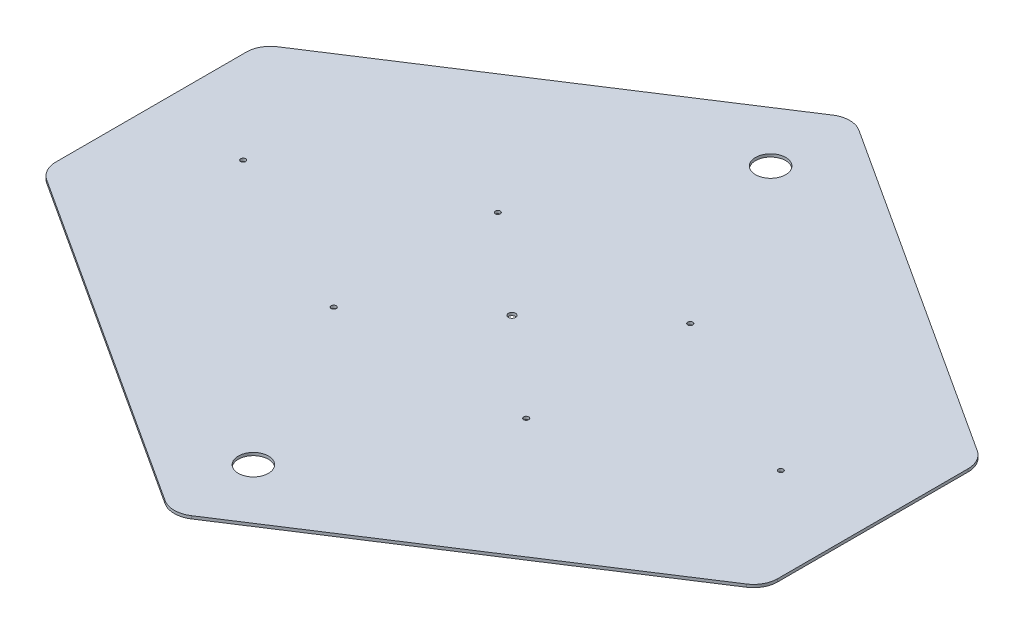
ISO-10303-21;
HEADER;
FILE_DESCRIPTION(('STEP AP214'),'2;1');
FILE_NAME('part.step','',(''),(''),'','','');
FILE_SCHEMA(('AUTOMOTIVE_DESIGN { 1 0 10303 214 1 1 1 1 }'));
ENDSEC;
DATA;
#1=APPLICATION_CONTEXT('core data for automotive mechanical design processes');
#2=APPLICATION_PROTOCOL_DEFINITION('international standard','automotive_design',2000,#1);
#3=PRODUCT_CONTEXT('',#1,'mechanical');
#4=PRODUCT('Part','Part','',(#3));
#5=PRODUCT_RELATED_PRODUCT_CATEGORY('part','',(#4));
#6=PRODUCT_DEFINITION_FORMATION('','',#4);
#7=PRODUCT_DEFINITION_CONTEXT('part definition',#1,'design');
#8=PRODUCT_DEFINITION('design','',#6,#7);
#9=PRODUCT_DEFINITION_SHAPE('','',#8);
#10=(LENGTH_UNIT() NAMED_UNIT(*) SI_UNIT(.MILLI.,.METRE.));
#11=(NAMED_UNIT(*) PLANE_ANGLE_UNIT() SI_UNIT($,.RADIAN.));
#12=(NAMED_UNIT(*) SI_UNIT($,.STERADIAN.) SOLID_ANGLE_UNIT());
#13=UNCERTAINTY_MEASURE_WITH_UNIT(LENGTH_MEASURE(1.E-05),#10,'distance_accuracy_value','');
#14=(GEOMETRIC_REPRESENTATION_CONTEXT(3) GLOBAL_UNCERTAINTY_ASSIGNED_CONTEXT((#13)) GLOBAL_UNIT_ASSIGNED_CONTEXT((#10,
#11,#12)) REPRESENTATION_CONTEXT('',''));
#15=CARTESIAN_POINT('',(0.,0.,0.));
#16=DIRECTION('',(0.,0.,1.));
#17=DIRECTION('',(1.,0.,0.));
#18=AXIS2_PLACEMENT_3D('',#15,#16,#17);
#19=CARTESIAN_POINT('',(-355.6,3.,-100.49901923));
#20=DIRECTION('',(0.,-1.,0.));
#21=DIRECTION('',(0.,0.,-1.));
#22=AXIS2_PLACEMENT_3D('',#19,#20,#21);
#23=CYLINDRICAL_SURFACE('',#22,25.4);
#24=CARTESIAN_POINT('',(-355.6,3.,-100.49901923));
#25=DIRECTION('',(0.,-1.,0.));
#26=DIRECTION('',(0.,0.,-1.));
#27=AXIS2_PLACEMENT_3D('',#24,#25,#26);
#28=CIRCLE('',#27,25.4);
#29=CARTESIAN_POINT('',(-369.420998399086,3.,-121.809580018374));
#30=VERTEX_POINT('',#29);
#31=CARTESIAN_POINT('',(-381.,3.,-100.49901923));
#32=VERTEX_POINT('',#31);
#33=EDGE_CURVE('E208',#30,#32,#28,.F.);
#34=ORIENTED_EDGE('',*,*,#33,.F.);
#35=DIRECTION('',(0.,-1.,0.));
#36=VECTOR('',#35,1.);
#37=CARTESIAN_POINT('',(-369.420998419,1.5,-121.809580055));
#38=LINE('',#37,#36);
#39=CARTESIAN_POINT('',(-369.420998418857,0.,-121.809580055093));
#40=VERTEX_POINT('',#39);
#41=EDGE_CURVE('E131',#30,#40,#38,.T.);
#42=ORIENTED_EDGE('',*,*,#41,.T.);
#43=CARTESIAN_POINT('',(-355.6,0.,-100.49901923));
#44=DIRECTION('',(0.,-1.,0.));
#45=DIRECTION('',(0.,0.,-1.));
#46=AXIS2_PLACEMENT_3D('',#43,#44,#45);
#47=CIRCLE('',#46,25.4);
#48=CARTESIAN_POINT('',(-381.,0.,-100.49901923));
#49=VERTEX_POINT('',#48);
#50=EDGE_CURVE('E235',#40,#49,#47,.F.);
#51=ORIENTED_EDGE('',*,*,#50,.T.);
#52=DIRECTION('',(0.,1.,0.));
#53=VECTOR('',#52,1.);
#54=CARTESIAN_POINT('',(-381.,1.5,-100.49901923));
#55=LINE('',#54,#53);
#56=EDGE_CURVE('E161',#49,#32,#55,.T.);
#57=ORIENTED_EDGE('',*,*,#56,.T.);
#58=EDGE_LOOP('',(#34,#42,#51,#57));
#59=FACE_BOUND('',#58,.T.);
#60=ADVANCED_FACE('F17',(#59),#23,.T.);
#61=CARTESIAN_POINT('',(-381.,0.,100.49901923));
#62=DIRECTION('',(1.,0.,0.));
#63=DIRECTION('',(0.,0.,-1.));
#64=AXIS2_PLACEMENT_3D('',#61,#62,#63);
#65=PLANE('',#64);
#66=ORIENTED_EDGE('',*,*,#56,.F.);
#67=DIRECTION('',(0.,0.,1.));
#68=VECTOR('',#67,1.);
#69=CARTESIAN_POINT('',(-381.,0.,0.));
#70=LINE('',#69,#68);
#71=CARTESIAN_POINT('',(-381.,0.,100.499019234886));
#72=VERTEX_POINT('',#71);
#73=EDGE_CURVE('E234',#49,#72,#70,.T.);
#74=ORIENTED_EDGE('',*,*,#73,.T.);
#75=DIRECTION('',(0.,-1.,0.));
#76=VECTOR('',#75,1.);
#77=CARTESIAN_POINT('',(-381.,1.5,100.499019239771));
#78=LINE('',#77,#76);
#79=CARTESIAN_POINT('',(-381.,3.,100.499019234886));
#80=VERTEX_POINT('',#79);
#81=EDGE_CURVE('E105',#72,#80,#78,.F.);
#82=ORIENTED_EDGE('',*,*,#81,.T.);
#83=DIRECTION('',(0.,0.,1.));
#84=VECTOR('',#83,1.);
#85=CARTESIAN_POINT('',(-381.,3.,0.));
#86=LINE('',#85,#84);
#87=EDGE_CURVE('E207',#32,#80,#86,.T.);
#88=ORIENTED_EDGE('',*,*,#87,.F.);
#89=EDGE_LOOP('',(#66,#74,#82,#88));
#90=FACE_BOUND('',#89,.T.);
#91=ADVANCED_FACE('F263',(#90),#65,.F.);
#92=CARTESIAN_POINT('',(-355.6,3.,100.49901923));
#93=DIRECTION('',(0.,-1.,0.));
#94=DIRECTION('',(0.,0.,-1.));
#95=AXIS2_PLACEMENT_3D('',#92,#93,#94);
#96=CYLINDRICAL_SURFACE('',#95,25.4);
#97=CARTESIAN_POINT('',(-355.6,3.,100.49901923));
#98=DIRECTION('',(0.,-1.,0.));
#99=DIRECTION('',(0.,0.,-1.));
#100=AXIS2_PLACEMENT_3D('',#97,#98,#99);
#101=CIRCLE('',#100,25.4);
#102=CARTESIAN_POINT('',(-369.420998399086,3.,121.809580018374));
#103=VERTEX_POINT('',#102);
#104=EDGE_CURVE('E205',#80,#103,#101,.F.);
#105=ORIENTED_EDGE('',*,*,#104,.F.);
#106=ORIENTED_EDGE('',*,*,#81,.F.);
#107=CARTESIAN_POINT('',(-355.6,0.,100.49901923));
#108=DIRECTION('',(0.,-1.,0.));
#109=DIRECTION('',(0.,0.,-1.));
#110=AXIS2_PLACEMENT_3D('',#107,#108,#109);
#111=CIRCLE('',#110,25.4);
#112=CARTESIAN_POINT('',(-369.420998418857,0.,121.809580055093));
#113=VERTEX_POINT('',#112);
#114=EDGE_CURVE('E21',#72,#113,#111,.F.);
#115=ORIENTED_EDGE('',*,*,#114,.T.);
#116=DIRECTION('',(0.,1.,0.));
#117=VECTOR('',#116,1.);
#118=CARTESIAN_POINT('',(-369.420998419,1.5,121.809580055));
#119=LINE('',#118,#117);
#120=EDGE_CURVE('E112',#113,#103,#119,.T.);
#121=ORIENTED_EDGE('',*,*,#120,.T.);
#122=EDGE_LOOP('',(#105,#106,#115,#121));
#123=FACE_BOUND('',#122,.T.);
#124=ADVANCED_FACE('F129',(#123),#96,.T.);
#125=CARTESIAN_POINT('',(-13.820998419,0.,352.434530661));
#126=DIRECTION('',(0.544133796023305,0.,-0.838998457701364));
#127=DIRECTION('',(-0.838998457701364,0.,-0.544133796023305));
#128=AXIS2_PLACEMENT_3D('',#125,#126,#127);
#129=PLANE('',#128);
#130=DIRECTION('',(0.,-1.,0.));
#131=VECTOR('',#130,1.);
#132=CARTESIAN_POINT('',(-13.8209984173062,1.5,352.434530661708));
#133=LINE('',#132,#131);
#134=CARTESIAN_POINT('',(-13.8209984182382,0.,352.434530661299));
#135=VERTEX_POINT('',#134);
#136=CARTESIAN_POINT('',(-13.8209984292683,3.,352.434530672072));
#137=VERTEX_POINT('',#136);
#138=EDGE_CURVE('E118',#135,#137,#133,.F.);
#139=ORIENTED_EDGE('',*,*,#138,.T.);
#140=DIRECTION('',(0.838998457556023,0.,0.544133796247407));
#141=VECTOR('',#140,1.);
#142=CARTESIAN_POINT('',(-369.42099852,3.,121.809579890415));
#143=LINE('',#142,#141);
#144=EDGE_CURVE('E117',#103,#137,#143,.T.);
#145=ORIENTED_EDGE('',*,*,#144,.F.);
#146=ORIENTED_EDGE('',*,*,#120,.F.);
#147=DIRECTION('',(-0.838998457701364,0.,-0.544133796023305));
#148=VECTOR('',#147,1.);
#149=CARTESIAN_POINT('',(-13.820998419,0.,352.434530661));
#150=LINE('',#149,#148);
#151=EDGE_CURVE('E116',#113,#135,#150,.F.);
#152=ORIENTED_EDGE('',*,*,#151,.T.);
#153=EDGE_LOOP('',(#139,#145,#146,#152));
#154=FACE_BOUND('',#153,.T.);
#155=ADVANCED_FACE('F115',(#154),#129,.F.);
#156=CARTESIAN_POINT('',(0.,3.,331.123969835));
#157=DIRECTION('',(0.,-1.,0.));
#158=DIRECTION('',(0.,0.,-1.));
#159=AXIS2_PLACEMENT_3D('',#156,#157,#158);
#160=CYLINDRICAL_SURFACE('',#159,25.4);
#161=CARTESIAN_POINT('',(0.,3.,331.123969835));
#162=DIRECTION('',(0.,-1.,0.));
#163=DIRECTION('',(0.,0.,-1.));
#164=AXIS2_PLACEMENT_3D('',#161,#162,#163);
#165=CIRCLE('',#164,25.4);
#166=CARTESIAN_POINT('',(13.8209984301152,3.,352.434530671718));
#167=VERTEX_POINT('',#166);
#168=EDGE_CURVE('E202',#137,#167,#165,.F.);
#169=ORIENTED_EDGE('',*,*,#168,.F.);
#170=ORIENTED_EDGE('',*,*,#138,.F.);
#171=CARTESIAN_POINT('',(0.,0.,331.123969835));
#172=DIRECTION('',(0.,-1.,0.));
#173=DIRECTION('',(0.,0.,-1.));
#174=AXIS2_PLACEMENT_3D('',#171,#172,#173);
#175=CIRCLE('',#174,25.4);
#176=CARTESIAN_POINT('',(13.8209984190851,0.,352.434530660945));
#177=VERTEX_POINT('',#176);
#178=EDGE_CURVE('E128',#135,#177,#175,.F.);
#179=ORIENTED_EDGE('',*,*,#178,.T.);
#180=DIRECTION('',(0.,1.,0.));
#181=VECTOR('',#180,1.);
#182=CARTESIAN_POINT('',(13.820998419,1.5,352.434530661));
#183=LINE('',#182,#181);
#184=EDGE_CURVE('E156',#177,#167,#183,.T.);
#185=ORIENTED_EDGE('',*,*,#184,.T.);
#186=EDGE_LOOP('',(#169,#170,#179,#185));
#187=FACE_BOUND('',#186,.T.);
#188=ADVANCED_FACE('F257',(#187),#160,.T.);
#189=CARTESIAN_POINT('',(369.420998419,0.,121.809580055));
#190=DIRECTION('',(-0.544133796023305,0.,-0.838998457701364));
#191=DIRECTION('',(-0.838998457701364,0.,0.544133796023305));
#192=AXIS2_PLACEMENT_3D('',#189,#190,#191);
#193=PLANE('',#192);
#194=ORIENTED_EDGE('',*,*,#184,.F.);
#195=DIRECTION('',(-0.838998457701364,0.,0.544133796023305));
#196=VECTOR('',#195,1.);
#197=CARTESIAN_POINT('',(369.420998419,0.,121.809580055));
#198=LINE('',#197,#196);
#199=CARTESIAN_POINT('',(369.420998419923,0.,121.809580054706));
#200=VERTEX_POINT('',#199);
#201=EDGE_CURVE('E252',#177,#200,#198,.F.);
#202=ORIENTED_EDGE('',*,*,#201,.T.);
#203=DIRECTION('',(0.,-1.,0.));
#204=VECTOR('',#203,1.);
#205=CARTESIAN_POINT('',(369.420998421133,1.5,121.809580054226));
#206=LINE('',#205,#204);
#207=CARTESIAN_POINT('',(369.420998400153,3.,121.809580017987));
#208=VERTEX_POINT('',#207);
#209=EDGE_CURVE('E153',#200,#208,#206,.F.);
#210=ORIENTED_EDGE('',*,*,#209,.T.);
#211=DIRECTION('',(0.838998457556023,0.,-0.544133796247407));
#212=VECTOR('',#211,1.);
#213=CARTESIAN_POINT('',(13.820998266,3.,352.434530796082));
#214=LINE('',#213,#212);
#215=EDGE_CURVE('E200',#167,#208,#214,.T.);
#216=ORIENTED_EDGE('',*,*,#215,.F.);
#217=EDGE_LOOP('',(#194,#202,#210,#216));
#218=FACE_BOUND('',#217,.T.);
#219=ADVANCED_FACE('F342',(#218),#193,.F.);
#220=CARTESIAN_POINT('',(355.6,3.,100.49901923));
#221=DIRECTION('',(0.,-1.,0.));
#222=DIRECTION('',(0.,0.,-1.));
#223=AXIS2_PLACEMENT_3D('',#220,#221,#222);
#224=CYLINDRICAL_SURFACE('',#223,25.4);
#225=CARTESIAN_POINT('',(355.6,3.,100.49901923));
#226=DIRECTION('',(0.,-1.,0.));
#227=DIRECTION('',(0.,0.,-1.));
#228=AXIS2_PLACEMENT_3D('',#225,#226,#227);
#229=CIRCLE('',#228,25.4);
#230=CARTESIAN_POINT('',(381.,3.,100.49901923));
#231=VERTEX_POINT('',#230);
#232=EDGE_CURVE('E198',#208,#231,#229,.F.);
#233=ORIENTED_EDGE('',*,*,#232,.F.);
#234=ORIENTED_EDGE('',*,*,#209,.F.);
#235=CARTESIAN_POINT('',(355.6,0.,100.49901923));
#236=DIRECTION('',(0.,-1.,0.));
#237=DIRECTION('',(0.,0.,-1.));
#238=AXIS2_PLACEMENT_3D('',#235,#236,#237);
#239=CIRCLE('',#238,25.4);
#240=CARTESIAN_POINT('',(381.,0.,100.49901923));
#241=VERTEX_POINT('',#240);
#242=EDGE_CURVE('E249',#200,#241,#239,.F.);
#243=ORIENTED_EDGE('',*,*,#242,.T.);
#244=DIRECTION('',(0.,1.,0.));
#245=VECTOR('',#244,1.);
#246=CARTESIAN_POINT('',(381.,1.5,100.49901923));
#247=LINE('',#246,#245);
#248=EDGE_CURVE('E150',#241,#231,#247,.T.);
#249=ORIENTED_EDGE('',*,*,#248,.T.);
#250=EDGE_LOOP('',(#233,#234,#243,#249));
#251=FACE_BOUND('',#250,.T.);
#252=ADVANCED_FACE('F339',(#251),#224,.T.);
#253=CARTESIAN_POINT('',(381.,0.,-100.49901923));
#254=DIRECTION('',(-1.,0.,0.));
#255=DIRECTION('',(0.,0.,1.));
#256=AXIS2_PLACEMENT_3D('',#253,#254,#255);
#257=PLANE('',#256);
#258=ORIENTED_EDGE('',*,*,#248,.F.);
#259=DIRECTION('',(0.,0.,-1.));
#260=VECTOR('',#259,1.);
#261=CARTESIAN_POINT('',(381.,0.,0.));
#262=LINE('',#261,#260);
#263=CARTESIAN_POINT('',(381.,0.,-100.499019227395));
#264=VERTEX_POINT('',#263);
#265=EDGE_CURVE('E139',#241,#264,#262,.T.);
#266=ORIENTED_EDGE('',*,*,#265,.T.);
#267=DIRECTION('',(0.,-1.,0.));
#268=VECTOR('',#267,1.);
#269=CARTESIAN_POINT('',(381.,1.5,-100.49901922479));
#270=LINE('',#269,#268);
#271=CARTESIAN_POINT('',(381.,3.,-100.499019227395));
#272=VERTEX_POINT('',#271);
#273=EDGE_CURVE('E147',#264,#272,#270,.F.);
#274=ORIENTED_EDGE('',*,*,#273,.T.);
#275=DIRECTION('',(0.,0.,-1.));
#276=VECTOR('',#275,1.);
#277=CARTESIAN_POINT('',(381.,3.,0.));
#278=LINE('',#277,#276);
#279=EDGE_CURVE('E197',#231,#272,#278,.T.);
#280=ORIENTED_EDGE('',*,*,#279,.F.);
#281=EDGE_LOOP('',(#258,#266,#274,#280));
#282=FACE_BOUND('',#281,.T.);
#283=ADVANCED_FACE('F270',(#282),#257,.F.);
#284=CARTESIAN_POINT('',(355.6,3.,-100.49901923));
#285=DIRECTION('',(0.,-1.,0.));
#286=DIRECTION('',(0.,0.,-1.));
#287=AXIS2_PLACEMENT_3D('',#284,#285,#286);
#288=CYLINDRICAL_SURFACE('',#287,25.4);
#289=CARTESIAN_POINT('',(355.6,3.,-100.49901923));
#290=DIRECTION('',(0.,-1.,0.));
#291=DIRECTION('',(0.,0.,-1.));
#292=AXIS2_PLACEMENT_3D('',#289,#290,#291);
#293=CIRCLE('',#292,25.4);
#294=CARTESIAN_POINT('',(369.420998399086,3.,-121.809580018374));
#295=VERTEX_POINT('',#294);
#296=EDGE_CURVE('E195',#272,#295,#293,.F.);
#297=ORIENTED_EDGE('',*,*,#296,.F.);
#298=ORIENTED_EDGE('',*,*,#273,.F.);
#299=CARTESIAN_POINT('',(355.6,0.,-100.49901923));
#300=DIRECTION('',(0.,-1.,0.));
#301=DIRECTION('',(0.,0.,-1.));
#302=AXIS2_PLACEMENT_3D('',#299,#300,#301);
#303=CIRCLE('',#302,25.4);
#304=CARTESIAN_POINT('',(369.420998418857,0.,-121.809580055093));
#305=VERTEX_POINT('',#304);
#306=EDGE_CURVE('E246',#264,#305,#303,.F.);
#307=ORIENTED_EDGE('',*,*,#306,.T.);
#308=DIRECTION('',(0.,1.,0.));
#309=VECTOR('',#308,1.);
#310=CARTESIAN_POINT('',(369.420998419,1.5,-121.809580055));
#311=LINE('',#310,#309);
#312=EDGE_CURVE('E144',#305,#295,#311,.T.);
#313=ORIENTED_EDGE('',*,*,#312,.T.);
#314=EDGE_LOOP('',(#297,#298,#307,#313));
#315=FACE_BOUND('',#314,.T.);
#316=ADVANCED_FACE('F274',(#315),#288,.T.);
#317=CARTESIAN_POINT('',(13.820998419,0.,-352.434530661));
#318=DIRECTION('',(-0.544133796023305,0.,0.838998457701364));
#319=DIRECTION('',(0.838998457701364,0.,0.544133796023305));
#320=AXIS2_PLACEMENT_3D('',#317,#318,#319);
#321=PLANE('',#320);
#322=ORIENTED_EDGE('',*,*,#312,.F.);
#323=DIRECTION('',(0.838998457701364,0.,0.544133796023305));
#324=VECTOR('',#323,1.);
#325=CARTESIAN_POINT('',(13.820998419,0.,-352.434530661));
#326=LINE('',#325,#324);
#327=CARTESIAN_POINT('',(13.8209984138674,0.,-352.434530664133));
#328=VERTEX_POINT('',#327);
#329=EDGE_CURVE('E243',#305,#328,#326,.F.);
#330=ORIENTED_EDGE('',*,*,#329,.T.);
#331=DIRECTION('',(0.,-1.,0.));
#332=VECTOR('',#331,1.);
#333=CARTESIAN_POINT('',(13.8209984085645,1.5,-352.434530667377));
#334=LINE('',#333,#332);
#335=CARTESIAN_POINT('',(13.8209984248975,3.,-352.434530674907));
#336=VERTEX_POINT('',#335);
#337=EDGE_CURVE('E136',#328,#336,#334,.F.);
#338=ORIENTED_EDGE('',*,*,#337,.T.);
#339=DIRECTION('',(-0.838998457556022,0.,-0.544133796247408));
#340=VECTOR('',#339,1.);
#341=CARTESIAN_POINT('',(369.42099852,3.,-121.809579890414));
#342=LINE('',#341,#340);
#343=EDGE_CURVE('E193',#295,#336,#342,.T.);
#344=ORIENTED_EDGE('',*,*,#343,.F.);
#345=EDGE_LOOP('',(#322,#330,#338,#344));
#346=FACE_BOUND('',#345,.T.);
#347=ADVANCED_FACE('F278',(#346),#321,.F.);
#348=CARTESIAN_POINT('',(0.,3.,-331.123969835));
#349=DIRECTION('',(0.,-1.,0.));
#350=DIRECTION('',(0.,0.,-1.));
#351=AXIS2_PLACEMENT_3D('',#348,#349,#350);
#352=CYLINDRICAL_SURFACE('',#351,25.4);
#353=CARTESIAN_POINT('',(0.,3.,-331.123969835));
#354=DIRECTION('',(0.,-1.,0.));
#355=DIRECTION('',(0.,0.,-1.));
#356=AXIS2_PLACEMENT_3D('',#353,#354,#355);
#357=CIRCLE('',#356,25.4);
#358=CARTESIAN_POINT('',(-13.8209984301152,3.,-352.434530671718));
#359=VERTEX_POINT('',#358);
#360=EDGE_CURVE('E36',#336,#359,#357,.F.);
#361=ORIENTED_EDGE('',*,*,#360,.F.);
#362=ORIENTED_EDGE('',*,*,#337,.F.);
#363=CARTESIAN_POINT('',(0.,0.,-331.123969835));
#364=DIRECTION('',(0.,-1.,0.));
#365=DIRECTION('',(0.,0.,-1.));
#366=AXIS2_PLACEMENT_3D('',#363,#364,#365);
#367=CIRCLE('',#366,25.4);
#368=CARTESIAN_POINT('',(-13.8209984190851,0.,-352.434530660945));
#369=VERTEX_POINT('',#368);
#370=EDGE_CURVE('E241',#328,#369,#367,.F.);
#371=ORIENTED_EDGE('',*,*,#370,.T.);
#372=DIRECTION('',(0.,1.,0.));
#373=VECTOR('',#372,1.);
#374=CARTESIAN_POINT('',(-13.820998419,1.5,-352.434530661));
#375=LINE('',#374,#373);
#376=EDGE_CURVE('E130',#369,#359,#375,.T.);
#377=ORIENTED_EDGE('',*,*,#376,.T.);
#378=EDGE_LOOP('',(#361,#362,#371,#377));
#379=FACE_BOUND('',#378,.T.);
#380=ADVANCED_FACE('F280',(#379),#352,.T.);
#381=CARTESIAN_POINT('',(-369.420998419,0.,-121.809580055));
#382=DIRECTION('',(0.544133796023305,0.,0.838998457701364));
#383=DIRECTION('',(0.838998457701364,0.,-0.544133796023305));
#384=AXIS2_PLACEMENT_3D('',#381,#382,#383);
#385=PLANE('',#384);
#386=ORIENTED_EDGE('',*,*,#376,.F.);
#387=DIRECTION('',(0.838998457701364,0.,-0.544133796023305));
#388=VECTOR('',#387,1.);
#389=CARTESIAN_POINT('',(-369.420998419,0.,-121.809580055));
#390=LINE('',#389,#388);
#391=EDGE_CURVE('E238',#369,#40,#390,.F.);
#392=ORIENTED_EDGE('',*,*,#391,.T.);
#393=ORIENTED_EDGE('',*,*,#41,.F.);
#394=DIRECTION('',(-0.838998457556023,0.,0.544133796247408));
#395=VECTOR('',#394,1.);
#396=CARTESIAN_POINT('',(-13.8209982659999,3.,-352.434530796082));
#397=LINE('',#396,#395);
#398=EDGE_CURVE('E190',#359,#30,#397,.T.);
#399=ORIENTED_EDGE('',*,*,#398,.F.);
#400=EDGE_LOOP('',(#386,#392,#393,#399));
#401=FACE_BOUND('',#400,.T.);
#402=ADVANCED_FACE('F283',(#401),#385,.F.);
#403=CARTESIAN_POINT('',(101.600000046,0.,86.614));
#404=DIRECTION('',(0.,1.,0.));
#405=DIRECTION('',(0.,0.,1.));
#406=AXIS2_PLACEMENT_3D('',#403,#404,#405);
#407=CYLINDRICAL_SURFACE('',#406,2.667);
#408=CARTESIAN_POINT('',(101.600000046,0.,86.614));
#409=DIRECTION('',(0.,1.,0.));
#410=DIRECTION('',(0.,0.,1.));
#411=AXIS2_PLACEMENT_3D('',#408,#409,#410);
#412=CIRCLE('',#411,2.667);
#413=CARTESIAN_POINT('',(101.600000046,0.,89.281));
#414=VERTEX_POINT('',#413);
#415=EDGE_CURVE('E231',#414,#414,#412,.F.);
#416=ORIENTED_EDGE('',*,*,#415,.T.);
#417=EDGE_LOOP('',(#416));
#418=FACE_BOUND('',#417,.T.);
#419=CARTESIAN_POINT('',(101.600000046,3.,86.614));
#420=DIRECTION('',(0.,1.,0.));
#421=DIRECTION('',(0.,0.,1.));
#422=AXIS2_PLACEMENT_3D('',#419,#420,#421);
#423=CIRCLE('',#422,2.667);
#424=CARTESIAN_POINT('',(101.600000046,3.,89.281));
#425=VERTEX_POINT('',#424);
#426=EDGE_CURVE('E187',#425,#425,#423,.F.);
#427=ORIENTED_EDGE('',*,*,#426,.F.);
#428=EDGE_LOOP('',(#427));
#429=FACE_BOUND('',#428,.T.);
#430=ADVANCED_FACE('F330',(#418,#429),#407,.F.);
#431=CARTESIAN_POINT('',(-101.599999954,0.,-86.614));
#432=DIRECTION('',(0.,1.,0.));
#433=DIRECTION('',(0.,0.,1.));
#434=AXIS2_PLACEMENT_3D('',#431,#432,#433);
#435=CYLINDRICAL_SURFACE('',#434,2.66699999999999);
#436=CARTESIAN_POINT('',(-101.599999954,0.,-86.614));
#437=DIRECTION('',(0.,1.,0.));
#438=DIRECTION('',(0.,0.,1.));
#439=AXIS2_PLACEMENT_3D('',#436,#437,#438);
#440=CIRCLE('',#439,2.66699999999999);
#441=CARTESIAN_POINT('',(-101.599999954,0.,-83.947));
#442=VERTEX_POINT('',#441);
#443=EDGE_CURVE('E228',#442,#442,#440,.F.);
#444=ORIENTED_EDGE('',*,*,#443,.T.);
#445=EDGE_LOOP('',(#444));
#446=FACE_BOUND('',#445,.T.);
#447=CARTESIAN_POINT('',(-101.599999954,3.,-86.614));
#448=DIRECTION('',(0.,1.,0.));
#449=DIRECTION('',(0.,0.,1.));
#450=AXIS2_PLACEMENT_3D('',#447,#448,#449);
#451=CIRCLE('',#450,2.66699999999999);
#452=CARTESIAN_POINT('',(-101.599999954,3.,-83.947));
#453=VERTEX_POINT('',#452);
#454=EDGE_CURVE('E184',#453,#453,#451,.F.);
#455=ORIENTED_EDGE('',*,*,#454,.F.);
#456=EDGE_LOOP('',(#455));
#457=FACE_BOUND('',#456,.T.);
#458=ADVANCED_FACE('F326',(#446,#457),#435,.F.);
#459=CARTESIAN_POINT('',(101.600000046,0.,-86.614));
#460=DIRECTION('',(0.,1.,0.));
#461=DIRECTION('',(0.,0.,1.));
#462=AXIS2_PLACEMENT_3D('',#459,#460,#461);
#463=CYLINDRICAL_SURFACE('',#462,2.66699999999999);
#464=CARTESIAN_POINT('',(101.600000046,0.,-86.614));
#465=DIRECTION('',(0.,1.,0.));
#466=DIRECTION('',(0.,0.,1.));
#467=AXIS2_PLACEMENT_3D('',#464,#465,#466);
#468=CIRCLE('',#467,2.66699999999999);
#469=CARTESIAN_POINT('',(101.600000046,0.,-83.947));
#470=VERTEX_POINT('',#469);
#471=EDGE_CURVE('E225',#470,#470,#468,.F.);
#472=ORIENTED_EDGE('',*,*,#471,.T.);
#473=EDGE_LOOP('',(#472));
#474=FACE_BOUND('',#473,.T.);
#475=CARTESIAN_POINT('',(101.600000046,3.,-86.614));
#476=DIRECTION('',(0.,1.,0.));
#477=DIRECTION('',(0.,0.,1.));
#478=AXIS2_PLACEMENT_3D('',#475,#476,#477);
#479=CIRCLE('',#478,2.66699999999999);
#480=CARTESIAN_POINT('',(101.600000046,3.,-83.947));
#481=VERTEX_POINT('',#480);
#482=EDGE_CURVE('E181',#481,#481,#479,.F.);
#483=ORIENTED_EDGE('',*,*,#482,.F.);
#484=EDGE_LOOP('',(#483));
#485=FACE_BOUND('',#484,.T.);
#486=ADVANCED_FACE('F322',(#474,#485),#463,.F.);
#487=CARTESIAN_POINT('',(-101.599999954,0.,86.614));
#488=DIRECTION('',(0.,1.,0.));
#489=DIRECTION('',(0.,0.,1.));
#490=AXIS2_PLACEMENT_3D('',#487,#488,#489);
#491=CYLINDRICAL_SURFACE('',#490,2.667);
#492=CARTESIAN_POINT('',(-101.599999954,0.,86.614));
#493=DIRECTION('',(0.,1.,0.));
#494=DIRECTION('',(0.,0.,1.));
#495=AXIS2_PLACEMENT_3D('',#492,#493,#494);
#496=CIRCLE('',#495,2.667);
#497=CARTESIAN_POINT('',(-101.599999954,0.,89.281));
#498=VERTEX_POINT('',#497);
#499=EDGE_CURVE('E222',#498,#498,#496,.F.);
#500=ORIENTED_EDGE('',*,*,#499,.T.);
#501=EDGE_LOOP('',(#500));
#502=FACE_BOUND('',#501,.T.);
#503=CARTESIAN_POINT('',(-101.599999954,3.,86.614));
#504=DIRECTION('',(0.,1.,0.));
#505=DIRECTION('',(0.,0.,1.));
#506=AXIS2_PLACEMENT_3D('',#503,#504,#505);
#507=CIRCLE('',#506,2.667);
#508=CARTESIAN_POINT('',(-101.599999954,3.,89.281));
#509=VERTEX_POINT('',#508);
#510=EDGE_CURVE('E178',#509,#509,#507,.F.);
#511=ORIENTED_EDGE('',*,*,#510,.F.);
#512=EDGE_LOOP('',(#511));
#513=FACE_BOUND('',#512,.T.);
#514=ADVANCED_FACE('F318',(#502,#513),#491,.F.);
#515=CARTESIAN_POINT('',(-283.813999954,0.,0.));
#516=DIRECTION('',(0.,1.,0.));
#517=DIRECTION('',(0.,0.,1.));
#518=AXIS2_PLACEMENT_3D('',#515,#516,#517);
#519=CYLINDRICAL_SURFACE('',#518,2.667);
#520=CARTESIAN_POINT('',(-283.813999954,0.,0.));
#521=DIRECTION('',(0.,1.,0.));
#522=DIRECTION('',(0.,0.,1.));
#523=AXIS2_PLACEMENT_3D('',#520,#521,#522);
#524=CIRCLE('',#523,2.667);
#525=CARTESIAN_POINT('',(-283.813999954,0.,2.667));
#526=VERTEX_POINT('',#525);
#527=EDGE_CURVE('E219',#526,#526,#524,.F.);
#528=ORIENTED_EDGE('',*,*,#527,.T.);
#529=EDGE_LOOP('',(#528));
#530=FACE_BOUND('',#529,.T.);
#531=CARTESIAN_POINT('',(-283.813999954,3.,0.));
#532=DIRECTION('',(0.,1.,0.));
#533=DIRECTION('',(0.,0.,1.));
#534=AXIS2_PLACEMENT_3D('',#531,#532,#533);
#535=CIRCLE('',#534,2.667);
#536=CARTESIAN_POINT('',(-283.813999954,3.,2.667));
#537=VERTEX_POINT('',#536);
#538=EDGE_CURVE('E175',#537,#537,#535,.F.);
#539=ORIENTED_EDGE('',*,*,#538,.F.);
#540=EDGE_LOOP('',(#539));
#541=FACE_BOUND('',#540,.T.);
#542=ADVANCED_FACE('F314',(#530,#541),#519,.F.);
#543=CARTESIAN_POINT('',(283.813999954,0.,0.));
#544=DIRECTION('',(0.,1.,0.));
#545=DIRECTION('',(0.,0.,1.));
#546=AXIS2_PLACEMENT_3D('',#543,#544,#545);
#547=CYLINDRICAL_SURFACE('',#546,2.667);
#548=CARTESIAN_POINT('',(283.813999954,0.,0.));
#549=DIRECTION('',(0.,1.,0.));
#550=DIRECTION('',(0.,0.,1.));
#551=AXIS2_PLACEMENT_3D('',#548,#549,#550);
#552=CIRCLE('',#551,2.667);
#553=CARTESIAN_POINT('',(283.813999954,0.,2.667));
#554=VERTEX_POINT('',#553);
#555=EDGE_CURVE('E216',#554,#554,#552,.F.);
#556=ORIENTED_EDGE('',*,*,#555,.T.);
#557=EDGE_LOOP('',(#556));
#558=FACE_BOUND('',#557,.T.);
#559=CARTESIAN_POINT('',(283.813999954,3.,0.));
#560=DIRECTION('',(0.,1.,0.));
#561=DIRECTION('',(0.,0.,1.));
#562=AXIS2_PLACEMENT_3D('',#559,#560,#561);
#563=CIRCLE('',#562,2.667);
#564=CARTESIAN_POINT('',(283.813999954,3.,2.667));
#565=VERTEX_POINT('',#564);
#566=EDGE_CURVE('E172',#565,#565,#563,.F.);
#567=ORIENTED_EDGE('',*,*,#566,.F.);
#568=EDGE_LOOP('',(#567));
#569=FACE_BOUND('',#568,.T.);
#570=ADVANCED_FACE('F310',(#558,#569),#547,.F.);
#571=CARTESIAN_POINT('',(0.,0.,-273.05));
#572=DIRECTION('',(0.,1.,0.));
#573=DIRECTION('',(0.,0.,1.));
#574=AXIS2_PLACEMENT_3D('',#571,#572,#573);
#575=CYLINDRICAL_SURFACE('',#574,15.875);
#576=CARTESIAN_POINT('',(0.,0.,-273.05));
#577=DIRECTION('',(0.,1.,0.));
#578=DIRECTION('',(0.,0.,1.));
#579=AXIS2_PLACEMENT_3D('',#576,#577,#578);
#580=CIRCLE('',#579,15.875);
#581=CARTESIAN_POINT('',(0.,0.,-257.175));
#582=VERTEX_POINT('',#581);
#583=EDGE_CURVE('E213',#582,#582,#580,.F.);
#584=ORIENTED_EDGE('',*,*,#583,.T.);
#585=EDGE_LOOP('',(#584));
#586=FACE_BOUND('',#585,.T.);
#587=CARTESIAN_POINT('',(0.,3.,-273.05));
#588=DIRECTION('',(0.,1.,0.));
#589=DIRECTION('',(0.,0.,1.));
#590=AXIS2_PLACEMENT_3D('',#587,#588,#589);
#591=CIRCLE('',#590,15.875);
#592=CARTESIAN_POINT('',(0.,3.,-257.175));
#593=VERTEX_POINT('',#592);
#594=EDGE_CURVE('E169',#593,#593,#591,.F.);
#595=ORIENTED_EDGE('',*,*,#594,.F.);
#596=EDGE_LOOP('',(#595));
#597=FACE_BOUND('',#596,.T.);
#598=ADVANCED_FACE('F306',(#586,#597),#575,.F.);
#599=CARTESIAN_POINT('',(0.,0.,273.05));
#600=DIRECTION('',(0.,1.,0.));
#601=DIRECTION('',(0.,0.,1.));
#602=AXIS2_PLACEMENT_3D('',#599,#600,#601);
#603=CYLINDRICAL_SURFACE('',#602,15.875);
#604=CARTESIAN_POINT('',(0.,0.,273.05));
#605=DIRECTION('',(0.,1.,0.));
#606=DIRECTION('',(0.,0.,1.));
#607=AXIS2_PLACEMENT_3D('',#604,#605,#606);
#608=CIRCLE('',#607,15.875);
#609=CARTESIAN_POINT('',(0.,0.,288.925));
#610=VERTEX_POINT('',#609);
#611=EDGE_CURVE('E210',#610,#610,#608,.F.);
#612=ORIENTED_EDGE('',*,*,#611,.T.);
#613=EDGE_LOOP('',(#612));
#614=FACE_BOUND('',#613,.T.);
#615=CARTESIAN_POINT('',(0.,3.,273.05));
#616=DIRECTION('',(0.,1.,0.));
#617=DIRECTION('',(0.,0.,1.));
#618=AXIS2_PLACEMENT_3D('',#615,#616,#617);
#619=CIRCLE('',#618,15.875);
#620=CARTESIAN_POINT('',(0.,3.,288.925));
#621=VERTEX_POINT('',#620);
#622=EDGE_CURVE('E166',#621,#621,#619,.F.);
#623=ORIENTED_EDGE('',*,*,#622,.F.);
#624=EDGE_LOOP('',(#623));
#625=FACE_BOUND('',#624,.T.);
#626=ADVANCED_FACE('F303',(#614,#625),#603,.F.);
#627=CARTESIAN_POINT('',(-381.,0.,-360.802257473));
#628=DIRECTION('',(0.,1.,0.));
#629=DIRECTION('',(0.,0.,1.));
#630=AXIS2_PLACEMENT_3D('',#627,#628,#629);
#631=PLANE('',#630);
#632=ORIENTED_EDGE('',*,*,#611,.F.);
#633=EDGE_LOOP('',(#632));
#634=FACE_BOUND('',#633,.T.);
#635=ORIENTED_EDGE('',*,*,#583,.F.);
#636=EDGE_LOOP('',(#635));
#637=FACE_BOUND('',#636,.T.);
#638=ORIENTED_EDGE('',*,*,#555,.F.);
#639=EDGE_LOOP('',(#638));
#640=FACE_BOUND('',#639,.T.);
#641=ORIENTED_EDGE('',*,*,#527,.F.);
#642=EDGE_LOOP('',(#641));
#643=FACE_BOUND('',#642,.T.);
#644=ORIENTED_EDGE('',*,*,#499,.F.);
#645=EDGE_LOOP('',(#644));
#646=FACE_BOUND('',#645,.T.);
#647=ORIENTED_EDGE('',*,*,#471,.F.);
#648=EDGE_LOOP('',(#647));
#649=FACE_BOUND('',#648,.T.);
#650=ORIENTED_EDGE('',*,*,#443,.F.);
#651=EDGE_LOOP('',(#650));
#652=FACE_BOUND('',#651,.T.);
#653=ORIENTED_EDGE('',*,*,#415,.F.);
#654=EDGE_LOOP('',(#653));
#655=FACE_BOUND('',#654,.T.);
#656=CARTESIAN_POINT('',(0.,0.,0.));
#657=DIRECTION('',(0.,1.,0.));
#658=DIRECTION('',(0.,0.,1.));
#659=AXIS2_PLACEMENT_3D('',#656,#657,#658);
#660=CIRCLE('',#659,3.81);
#661=CARTESIAN_POINT('',(0.,0.,3.81));
#662=VERTEX_POINT('',#661);
#663=EDGE_CURVE('E27',#662,#662,#660,.F.);
#664=ORIENTED_EDGE('',*,*,#663,.F.);
#665=EDGE_LOOP('',(#664));
#666=FACE_BOUND('',#665,.T.);
#667=ORIENTED_EDGE('',*,*,#50,.F.);
#668=ORIENTED_EDGE('',*,*,#391,.F.);
#669=ORIENTED_EDGE('',*,*,#370,.F.);
#670=ORIENTED_EDGE('',*,*,#329,.F.);
#671=ORIENTED_EDGE('',*,*,#306,.F.);
#672=ORIENTED_EDGE('',*,*,#265,.F.);
#673=ORIENTED_EDGE('',*,*,#242,.F.);
#674=ORIENTED_EDGE('',*,*,#201,.F.);
#675=ORIENTED_EDGE('',*,*,#178,.F.);
#676=ORIENTED_EDGE('',*,*,#151,.F.);
#677=ORIENTED_EDGE('',*,*,#114,.F.);
#678=ORIENTED_EDGE('',*,*,#73,.F.);
#679=EDGE_LOOP('',(#667,#668,#669,#670,#671,#672,#673,#674,#675,#676,#677,#678));
#680=FACE_BOUND('',#679,.T.);
#681=ADVANCED_FACE('F123',(#634,#637,#640,#643,#646,#649,#652,#655,#666,#680),#631,.F.);
#682=CARTESIAN_POINT('',(-381.,3.,-360.802257473));
#683=DIRECTION('',(0.,1.,0.));
#684=DIRECTION('',(0.,0.,1.));
#685=AXIS2_PLACEMENT_3D('',#682,#683,#684);
#686=PLANE('',#685);
#687=ORIENTED_EDGE('',*,*,#622,.T.);
#688=EDGE_LOOP('',(#687));
#689=FACE_BOUND('',#688,.T.);
#690=ORIENTED_EDGE('',*,*,#594,.T.);
#691=EDGE_LOOP('',(#690));
#692=FACE_BOUND('',#691,.T.);
#693=ORIENTED_EDGE('',*,*,#566,.T.);
#694=EDGE_LOOP('',(#693));
#695=FACE_BOUND('',#694,.T.);
#696=ORIENTED_EDGE('',*,*,#538,.T.);
#697=EDGE_LOOP('',(#696));
#698=FACE_BOUND('',#697,.T.);
#699=ORIENTED_EDGE('',*,*,#510,.T.);
#700=EDGE_LOOP('',(#699));
#701=FACE_BOUND('',#700,.T.);
#702=ORIENTED_EDGE('',*,*,#482,.T.);
#703=EDGE_LOOP('',(#702));
#704=FACE_BOUND('',#703,.T.);
#705=ORIENTED_EDGE('',*,*,#454,.T.);
#706=EDGE_LOOP('',(#705));
#707=FACE_BOUND('',#706,.T.);
#708=ORIENTED_EDGE('',*,*,#426,.T.);
#709=EDGE_LOOP('',(#708));
#710=FACE_BOUND('',#709,.T.);
#711=CARTESIAN_POINT('',(0.,3.,0.));
#712=DIRECTION('',(0.,1.,0.));
#713=DIRECTION('',(0.,0.,1.));
#714=AXIS2_PLACEMENT_3D('',#711,#712,#713);
#715=CIRCLE('',#714,3.81);
#716=CARTESIAN_POINT('',(0.,3.,3.81));
#717=VERTEX_POINT('',#716);
#718=EDGE_CURVE('E11',#717,#717,#715,.T.);
#719=ORIENTED_EDGE('',*,*,#718,.F.);
#720=EDGE_LOOP('',(#719));
#721=FACE_BOUND('',#720,.T.);
#722=ORIENTED_EDGE('',*,*,#360,.T.);
#723=ORIENTED_EDGE('',*,*,#398,.T.);
#724=ORIENTED_EDGE('',*,*,#33,.T.);
#725=ORIENTED_EDGE('',*,*,#87,.T.);
#726=ORIENTED_EDGE('',*,*,#104,.T.);
#727=ORIENTED_EDGE('',*,*,#144,.T.);
#728=ORIENTED_EDGE('',*,*,#168,.T.);
#729=ORIENTED_EDGE('',*,*,#215,.T.);
#730=ORIENTED_EDGE('',*,*,#232,.T.);
#731=ORIENTED_EDGE('',*,*,#279,.T.);
#732=ORIENTED_EDGE('',*,*,#296,.T.);
#733=ORIENTED_EDGE('',*,*,#343,.T.);
#734=EDGE_LOOP('',(#722,#723,#724,#725,#726,#727,#728,#729,#730,#731,#732,#733));
#735=FACE_BOUND('',#734,.T.);
#736=ADVANCED_FACE('F19',(#689,#692,#695,#698,#701,#704,#707,#710,#721,#735),#686,.T.);
#737=CARTESIAN_POINT('',(0.,0.,0.));
#738=DIRECTION('',(0.,1.,0.));
#739=DIRECTION('',(0.,0.,1.));
#740=AXIS2_PLACEMENT_3D('',#737,#738,#739);
#741=CYLINDRICAL_SURFACE('',#740,3.81);
#742=ORIENTED_EDGE('',*,*,#718,.T.);
#743=EDGE_LOOP('',(#742));
#744=FACE_BOUND('',#743,.T.);
#745=ORIENTED_EDGE('',*,*,#663,.T.);
#746=EDGE_LOOP('',(#745));
#747=FACE_BOUND('',#746,.T.);
#748=ADVANCED_FACE('F293',(#744,#747),#741,.F.);
#749=CLOSED_SHELL('',(#60,#91,#124,#155,#188,#219,#252,#283,#316,#347,#380,#402,#430,#458,#486,
#514,#542,#570,#598,#626,#681,#736,#748));
#750=MANIFOLD_SOLID_BREP('B1',#749);
#751=ADVANCED_BREP_SHAPE_REPRESENTATION('',(#18,#750),#14);
#752=SHAPE_DEFINITION_REPRESENTATION(#9,#751);
ENDSEC;
END-ISO-10303-21;
